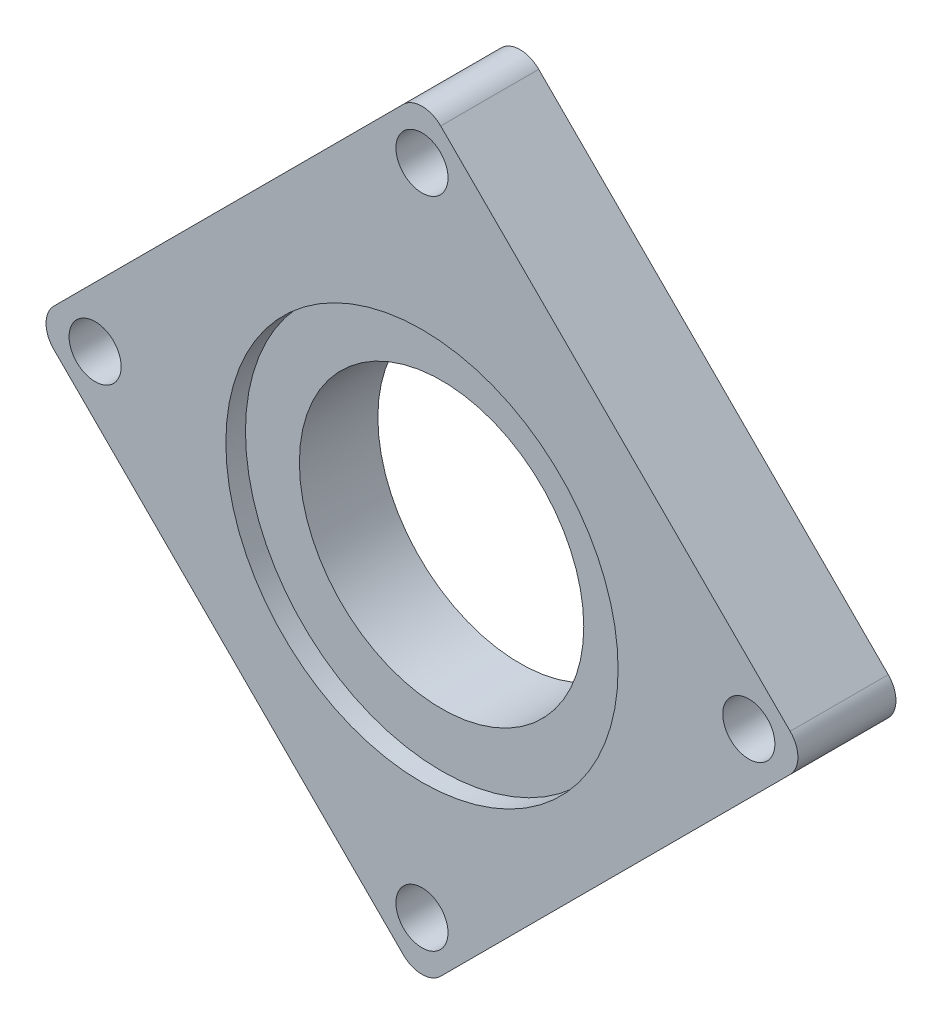
ISO-10303-21;
HEADER;
FILE_DESCRIPTION(('STEP AP214'),'2;1');
FILE_NAME('part.step','',(''),(''),'','','');
FILE_SCHEMA(('AUTOMOTIVE_DESIGN { 1 0 10303 214 1 1 1 1 }'));
ENDSEC;
DATA;
#1=APPLICATION_CONTEXT('core data for automotive mechanical design processes');
#2=APPLICATION_PROTOCOL_DEFINITION('international standard','automotive_design',2000,#1);
#3=PRODUCT_CONTEXT('',#1,'mechanical');
#4=PRODUCT('Part','Part','',(#3));
#5=PRODUCT_RELATED_PRODUCT_CATEGORY('part','',(#4));
#6=PRODUCT_DEFINITION_FORMATION('','',#4);
#7=PRODUCT_DEFINITION_CONTEXT('part definition',#1,'design');
#8=PRODUCT_DEFINITION('design','',#6,#7);
#9=PRODUCT_DEFINITION_SHAPE('','',#8);
#10=(LENGTH_UNIT() NAMED_UNIT(*) SI_UNIT(.MILLI.,.METRE.));
#11=(NAMED_UNIT(*) PLANE_ANGLE_UNIT() SI_UNIT($,.RADIAN.));
#12=(NAMED_UNIT(*) SI_UNIT($,.STERADIAN.) SOLID_ANGLE_UNIT());
#13=UNCERTAINTY_MEASURE_WITH_UNIT(LENGTH_MEASURE(1.E-05),#10,'distance_accuracy_value','');
#14=(GEOMETRIC_REPRESENTATION_CONTEXT(3) GLOBAL_UNCERTAINTY_ASSIGNED_CONTEXT((#13)) GLOBAL_UNIT_ASSIGNED_CONTEXT((#10,
#11,#12)) REPRESENTATION_CONTEXT('',''));
#15=CARTESIAN_POINT('',(0.,0.,0.));
#16=DIRECTION('',(0.,0.,1.));
#17=DIRECTION('',(1.,0.,0.));
#18=AXIS2_PLACEMENT_3D('',#15,#16,#17);
#19=CARTESIAN_POINT('',(58.9093516025737,45.0772658132579,10.));
#20=DIRECTION('',(0.,0.,-1.));
#21=DIRECTION('',(-1.,0.,0.));
#22=AXIS2_PLACEMENT_3D('',#19,#20,#21);
#23=CYLINDRICAL_SURFACE('',#22,14.5);
#24=CARTESIAN_POINT('',(58.9093516025737,45.0772658132579,0.));
#25=DIRECTION('',(0.,0.,1.));
#26=DIRECTION('',(1.,0.,0.));
#27=AXIS2_PLACEMENT_3D('',#24,#25,#26);
#28=CIRCLE('',#27,14.5);
#29=CARTESIAN_POINT('',(73.4093516025737,45.0772658132579,0.));
#30=VERTEX_POINT('',#29);
#31=EDGE_CURVE('E138',#30,#30,#28,.T.);
#32=ORIENTED_EDGE('',*,*,#31,.F.);
#33=EDGE_LOOP('',(#32));
#34=FACE_BOUND('',#33,.T.);
#35=CARTESIAN_POINT('',(58.9093516025737,45.0772658132579,8.));
#36=DIRECTION('',(0.,0.,1.));
#37=DIRECTION('',(1.,0.,0.));
#38=AXIS2_PLACEMENT_3D('',#35,#36,#37);
#39=CIRCLE('',#38,14.5);
#40=CARTESIAN_POINT('',(73.4093516025737,45.0772658132579,8.));
#41=VERTEX_POINT('',#40);
#42=EDGE_CURVE('E39',#41,#41,#39,.T.);
#43=ORIENTED_EDGE('',*,*,#42,.T.);
#44=EDGE_LOOP('',(#43));
#45=FACE_BOUND('',#44,.T.);
#46=ADVANCED_FACE('F35',(#34,#45),#23,.F.);
#47=CARTESIAN_POINT('',(94.5475333743754,46.4576834611031,10.));
#48=DIRECTION('',(0.,0.,1.));
#49=DIRECTION('',(1.,0.,0.));
#50=AXIS2_PLACEMENT_3D('',#47,#48,#49);
#51=PLANE('',#50);
#52=CARTESIAN_POINT('',(58.9093516025737,45.0772658132579,10.));
#53=DIRECTION('',(0.,0.,1.));
#54=DIRECTION('',(1.,0.,0.));
#55=AXIS2_PLACEMENT_3D('',#52,#53,#54);
#56=CIRCLE('',#55,20.);
#57=CARTESIAN_POINT('',(78.9093516025737,45.0772658132579,10.));
#58=VERTEX_POINT('',#57);
#59=EDGE_CURVE('E210',#58,#58,#56,.T.);
#60=ORIENTED_EDGE('',*,*,#59,.F.);
#61=EDGE_LOOP('',(#60));
#62=FACE_BOUND('',#61,.T.);
#63=CARTESIAN_POINT('',(58.9093516025736,79.7906971262372,10.));
#64=DIRECTION('',(0.,0.,1.));
#65=DIRECTION('',(1.,0.,0.));
#66=AXIS2_PLACEMENT_3D('',#63,#64,#65);
#67=CIRCLE('',#66,2.65560296279747);
#68=CARTESIAN_POINT('',(61.564954565371,79.7906971262372,10.));
#69=VERTEX_POINT('',#68);
#70=EDGE_CURVE('E196',#69,#69,#67,.T.);
#71=ORIENTED_EDGE('',*,*,#70,.F.);
#72=EDGE_LOOP('',(#71));
#73=FACE_BOUND('',#72,.T.);
#74=CARTESIAN_POINT('',(58.9093516025732,13.1246697959693,10.));
#75=DIRECTION('',(0.,0.,1.));
#76=DIRECTION('',(1.,0.,0.));
#77=AXIS2_PLACEMENT_3D('',#74,#75,#76);
#78=CIRCLE('',#77,2.65560296279745);
#79=CARTESIAN_POINT('',(61.5649545653707,13.1246697959693,10.));
#80=VERTEX_POINT('',#79);
#81=EDGE_CURVE('E186',#80,#80,#78,.T.);
#82=ORIENTED_EDGE('',*,*,#81,.F.);
#83=EDGE_LOOP('',(#82));
#84=FACE_BOUND('',#83,.T.);
#85=CARTESIAN_POINT('',(94.5475333743754,46.4576834611031,10.));
#86=DIRECTION('',(0.,0.,1.));
#87=DIRECTION('',(1.,0.,0.));
#88=AXIS2_PLACEMENT_3D('',#85,#86,#87);
#89=CIRCLE('',#88,2.7);
#90=CARTESIAN_POINT('',(96.4567216835791,44.5484951518994,10.));
#91=VERTEX_POINT('',#90);
#92=CARTESIAN_POINT('',(96.4567216835791,48.3668717703068,10.));
#93=VERTEX_POINT('',#92);
#94=EDGE_CURVE('E152',#91,#93,#89,.T.);
#95=ORIENTED_EDGE('',*,*,#94,.T.);
#96=DIRECTION('',(-0.707106781186543,0.707106781186552,0.));
#97=VECTOR('',#96,1.);
#98=CARTESIAN_POINT('',(96.4567216835791,48.3668717703068,10.));
#99=LINE('',#98,#97);
#100=CARTESIAN_POINT('',(60.8185399117773,84.005053542109,10.));
#101=VERTEX_POINT('',#100);
#102=EDGE_CURVE('E94',#93,#101,#99,.T.);
#103=ORIENTED_EDGE('',*,*,#102,.T.);
#104=CARTESIAN_POINT('',(58.9093516025737,82.0958652329053,10.));
#105=DIRECTION('',(0.,0.,1.));
#106=DIRECTION('',(1.,0.,0.));
#107=AXIS2_PLACEMENT_3D('',#104,#105,#106);
#108=CIRCLE('',#107,2.69999999999999);
#109=CARTESIAN_POINT('',(57.00016329337,84.005053542109,10.));
#110=VERTEX_POINT('',#109);
#111=EDGE_CURVE('E168',#101,#110,#108,.T.);
#112=ORIENTED_EDGE('',*,*,#111,.T.);
#113=DIRECTION('',(-0.707106781186552,-0.707106781186543,0.));
#114=VECTOR('',#113,1.);
#115=CARTESIAN_POINT('',(57.00016329337,84.005053542109,10.));
#116=LINE('',#115,#114);
#117=CARTESIAN_POINT('',(21.3619815215678,48.3668717703072,10.));
#118=VERTEX_POINT('',#117);
#119=EDGE_CURVE('E178',#110,#118,#116,.T.);
#120=ORIENTED_EDGE('',*,*,#119,.T.);
#121=CARTESIAN_POINT('',(23.2711698307715,46.4576834611035,10.));
#122=DIRECTION('',(0.,0.,1.));
#123=DIRECTION('',(1.,0.,0.));
#124=AXIS2_PLACEMENT_3D('',#121,#122,#123);
#125=CIRCLE('',#124,2.70000000000001);
#126=CARTESIAN_POINT('',(21.3619815215678,44.5484951518999,10.));
#127=VERTEX_POINT('',#126);
#128=EDGE_CURVE('E115',#118,#127,#125,.T.);
#129=ORIENTED_EDGE('',*,*,#128,.T.);
#130=DIRECTION('',(0.707106781186543,-0.707106781186552,0.));
#131=VECTOR('',#130,1.);
#132=CARTESIAN_POINT('',(21.3619815215678,44.5484951518999,10.));
#133=LINE('',#132,#131);
#134=CARTESIAN_POINT('',(57.0001632933695,8.91031338009766,10.));
#135=VERTEX_POINT('',#134);
#136=EDGE_CURVE('E107',#127,#135,#133,.T.);
#137=ORIENTED_EDGE('',*,*,#136,.T.);
#138=CARTESIAN_POINT('',(58.9093516025732,10.8195016893013,10.));
#139=DIRECTION('',(0.,0.,1.));
#140=DIRECTION('',(1.,0.,0.));
#141=AXIS2_PLACEMENT_3D('',#138,#139,#140);
#142=CIRCLE('',#141,2.7);
#143=CARTESIAN_POINT('',(60.8185399117769,8.91031338009764,10.));
#144=VERTEX_POINT('',#143);
#145=EDGE_CURVE('E112',#135,#144,#142,.T.);
#146=ORIENTED_EDGE('',*,*,#145,.T.);
#147=DIRECTION('',(0.707106781186552,0.707106781186543,0.));
#148=VECTOR('',#147,1.);
#149=CARTESIAN_POINT('',(60.8185399117769,8.91031338009764,10.));
#150=LINE('',#149,#148);
#151=EDGE_CURVE('E53',#144,#91,#150,.T.);
#152=ORIENTED_EDGE('',*,*,#151,.T.);
#153=EDGE_LOOP('',(#95,#103,#112,#120,#129,#137,#146,#152));
#154=FACE_BOUND('',#153,.T.);
#155=CARTESIAN_POINT('',(92.2423652677073,46.4576834611031,10.));
#156=DIRECTION('',(0.,0.,1.));
#157=DIRECTION('',(1.,0.,0.));
#158=AXIS2_PLACEMENT_3D('',#155,#156,#157);
#159=CIRCLE('',#158,2.65560296279748);
#160=CARTESIAN_POINT('',(94.8979682305048,46.4576834611031,10.));
#161=VERTEX_POINT('',#160);
#162=EDGE_CURVE('E190',#161,#161,#159,.T.);
#163=ORIENTED_EDGE('',*,*,#162,.F.);
#164=EDGE_LOOP('',(#163));
#165=FACE_BOUND('',#164,.T.);
#166=CARTESIAN_POINT('',(25.5763379374397,46.4576834611035,10.));
#167=DIRECTION('',(0.,0.,1.));
#168=DIRECTION('',(1.,0.,0.));
#169=AXIS2_PLACEMENT_3D('',#166,#167,#168);
#170=CIRCLE('',#169,2.65560296279746);
#171=CARTESIAN_POINT('',(28.2319409002371,46.4576834611035,10.));
#172=VERTEX_POINT('',#171);
#173=EDGE_CURVE('E202',#172,#172,#170,.T.);
#174=ORIENTED_EDGE('',*,*,#173,.F.);
#175=EDGE_LOOP('',(#174));
#176=FACE_BOUND('',#175,.T.);
#177=ADVANCED_FACE('F109',(#62,#73,#84,#154,#165,#176),#51,.T.);
#178=CARTESIAN_POINT('',(94.5475333743754,46.4576834611031,0.));
#179=DIRECTION('',(0.,0.,1.));
#180=DIRECTION('',(1.,0.,0.));
#181=AXIS2_PLACEMENT_3D('',#178,#179,#180);
#182=PLANE('',#181);
#183=CARTESIAN_POINT('',(94.5475333743754,46.4576834611031,0.));
#184=DIRECTION('',(0.,0.,1.));
#185=DIRECTION('',(1.,0.,0.));
#186=AXIS2_PLACEMENT_3D('',#183,#184,#185);
#187=CIRCLE('',#186,2.7);
#188=CARTESIAN_POINT('',(96.4567216835791,44.5484951518994,0.));
#189=VERTEX_POINT('',#188);
#190=CARTESIAN_POINT('',(96.4567216835791,48.3668717703068,0.));
#191=VERTEX_POINT('',#190);
#192=EDGE_CURVE('E134',#189,#191,#187,.T.);
#193=ORIENTED_EDGE('',*,*,#192,.F.);
#194=DIRECTION('',(0.707106781186552,0.707106781186543,0.));
#195=VECTOR('',#194,1.);
#196=CARTESIAN_POINT('',(92.4262130308157,40.5179864991361,0.));
#197=LINE('',#196,#195);
#198=CARTESIAN_POINT('',(60.8185399117769,8.91031338009764,0.));
#199=VERTEX_POINT('',#198);
#200=EDGE_CURVE('E82',#199,#189,#197,.T.);
#201=ORIENTED_EDGE('',*,*,#200,.F.);
#202=CARTESIAN_POINT('',(58.9093516025732,10.8195016893013,0.));
#203=DIRECTION('',(0.,0.,1.));
#204=DIRECTION('',(1.,0.,0.));
#205=AXIS2_PLACEMENT_3D('',#202,#203,#204);
#206=CIRCLE('',#205,2.7);
#207=CARTESIAN_POINT('',(57.0001632933695,8.91031338009766,0.));
#208=VERTEX_POINT('',#207);
#209=EDGE_CURVE('E149',#208,#199,#206,.T.);
#210=ORIENTED_EDGE('',*,*,#209,.F.);
#211=DIRECTION('',(0.707106781186543,-0.707106781186552,0.));
#212=VECTOR('',#211,1.);
#213=CARTESIAN_POINT('',(52.9696546406062,12.940822032861,0.));
#214=LINE('',#213,#212);
#215=CARTESIAN_POINT('',(21.3619815215678,44.5484951518999,0.));
#216=VERTEX_POINT('',#215);
#217=EDGE_CURVE('E123',#216,#208,#214,.T.);
#218=ORIENTED_EDGE('',*,*,#217,.F.);
#219=CARTESIAN_POINT('',(23.2711698307715,46.4576834611035,0.));
#220=DIRECTION('',(0.,0.,1.));
#221=DIRECTION('',(1.,0.,0.));
#222=AXIS2_PLACEMENT_3D('',#219,#220,#221);
#223=CIRCLE('',#222,2.70000000000001);
#224=CARTESIAN_POINT('',(21.3619815215678,48.3668717703072,0.));
#225=VERTEX_POINT('',#224);
#226=EDGE_CURVE('E145',#225,#216,#223,.T.);
#227=ORIENTED_EDGE('',*,*,#226,.F.);
#228=DIRECTION('',(-0.707106781186553,-0.707106781186542,0.));
#229=VECTOR('',#228,1.);
#230=CARTESIAN_POINT('',(25.3924901743311,52.3973804230705,0.));
#231=LINE('',#230,#229);
#232=CARTESIAN_POINT('',(57.00016329337,84.005053542109,0.));
#233=VERTEX_POINT('',#232);
#234=EDGE_CURVE('E143',#233,#225,#231,.T.);
#235=ORIENTED_EDGE('',*,*,#234,.F.);
#236=CARTESIAN_POINT('',(58.9093516025737,82.0958652329053,0.));
#237=DIRECTION('',(0.,0.,1.));
#238=DIRECTION('',(1.,0.,0.));
#239=AXIS2_PLACEMENT_3D('',#236,#237,#238);
#240=CIRCLE('',#239,2.69999999999999);
#241=CARTESIAN_POINT('',(60.8185399117773,84.005053542109,0.));
#242=VERTEX_POINT('',#241);
#243=EDGE_CURVE('E140',#242,#233,#240,.T.);
#244=ORIENTED_EDGE('',*,*,#243,.F.);
#245=DIRECTION('',(-0.707106781186543,0.707106781186552,0.));
#246=VECTOR('',#245,1.);
#247=CARTESIAN_POINT('',(64.8490485645406,79.9745448893457,0.));
#248=LINE('',#247,#246);
#249=EDGE_CURVE('E137',#191,#242,#248,.T.);
#250=ORIENTED_EDGE('',*,*,#249,.F.);
#251=EDGE_LOOP('',(#193,#201,#210,#218,#227,#235,#244,#250));
#252=FACE_BOUND('',#251,.T.);
#253=ORIENTED_EDGE('',*,*,#31,.T.);
#254=EDGE_LOOP('',(#253));
#255=FACE_BOUND('',#254,.T.);
#256=CARTESIAN_POINT('',(58.9093516025732,13.1246697959693,0.));
#257=DIRECTION('',(0.,0.,1.));
#258=DIRECTION('',(1.,0.,0.));
#259=AXIS2_PLACEMENT_3D('',#256,#257,#258);
#260=CIRCLE('',#259,2.65560296279745);
#261=CARTESIAN_POINT('',(61.5649545653707,13.1246697959693,0.));
#262=VERTEX_POINT('',#261);
#263=EDGE_CURVE('E187',#262,#262,#260,.T.);
#264=ORIENTED_EDGE('',*,*,#263,.T.);
#265=EDGE_LOOP('',(#264));
#266=FACE_BOUND('',#265,.T.);
#267=CARTESIAN_POINT('',(92.2423652677073,46.4576834611031,0.));
#268=DIRECTION('',(0.,0.,1.));
#269=DIRECTION('',(1.,0.,0.));
#270=AXIS2_PLACEMENT_3D('',#267,#268,#269);
#271=CIRCLE('',#270,2.65560296279748);
#272=CARTESIAN_POINT('',(94.8979682305048,46.4576834611031,0.));
#273=VERTEX_POINT('',#272);
#274=EDGE_CURVE('E193',#273,#273,#271,.T.);
#275=ORIENTED_EDGE('',*,*,#274,.T.);
#276=EDGE_LOOP('',(#275));
#277=FACE_BOUND('',#276,.T.);
#278=CARTESIAN_POINT('',(58.9093516025736,79.7906971262372,0.));
#279=DIRECTION('',(0.,0.,1.));
#280=DIRECTION('',(1.,0.,0.));
#281=AXIS2_PLACEMENT_3D('',#278,#279,#280);
#282=CIRCLE('',#281,2.65560296279747);
#283=CARTESIAN_POINT('',(61.564954565371,79.7906971262372,0.));
#284=VERTEX_POINT('',#283);
#285=EDGE_CURVE('E199',#284,#284,#282,.T.);
#286=ORIENTED_EDGE('',*,*,#285,.T.);
#287=EDGE_LOOP('',(#286));
#288=FACE_BOUND('',#287,.T.);
#289=CARTESIAN_POINT('',(25.5763379374397,46.4576834611035,0.));
#290=DIRECTION('',(0.,0.,1.));
#291=DIRECTION('',(1.,0.,0.));
#292=AXIS2_PLACEMENT_3D('',#289,#290,#291);
#293=CIRCLE('',#292,2.65560296279746);
#294=CARTESIAN_POINT('',(28.2319409002371,46.4576834611035,0.));
#295=VERTEX_POINT('',#294);
#296=EDGE_CURVE('E205',#295,#295,#293,.T.);
#297=ORIENTED_EDGE('',*,*,#296,.T.);
#298=EDGE_LOOP('',(#297));
#299=FACE_BOUND('',#298,.T.);
#300=ADVANCED_FACE('F169',(#252,#255,#266,#277,#288,#299),#182,.F.);
#301=CARTESIAN_POINT('',(94.5475333743754,46.4576834611031,10.));
#302=DIRECTION('',(0.,0.,-1.));
#303=DIRECTION('',(-1.,0.,0.));
#304=AXIS2_PLACEMENT_3D('',#301,#302,#303);
#305=CYLINDRICAL_SURFACE('',#304,2.7);
#306=ORIENTED_EDGE('',*,*,#192,.T.);
#307=DIRECTION('',(0.,0.,-1.));
#308=VECTOR('',#307,1.);
#309=CARTESIAN_POINT('',(96.4567216835791,48.3668717703068,10.));
#310=LINE('',#309,#308);
#311=EDGE_CURVE('E11',#93,#191,#310,.T.);
#312=ORIENTED_EDGE('',*,*,#311,.F.);
#313=ORIENTED_EDGE('',*,*,#94,.F.);
#314=DIRECTION('',(0.,0.,-1.));
#315=VECTOR('',#314,1.);
#316=CARTESIAN_POINT('',(96.4567216835791,44.5484951518994,10.));
#317=LINE('',#316,#315);
#318=EDGE_CURVE('E130',#91,#189,#317,.T.);
#319=ORIENTED_EDGE('',*,*,#318,.T.);
#320=EDGE_LOOP('',(#306,#312,#313,#319));
#321=FACE_BOUND('',#320,.T.);
#322=ADVANCED_FACE('F37',(#321),#305,.T.);
#323=CARTESIAN_POINT('',(64.8490485645406,79.9745448893457,10.));
#324=DIRECTION('',(-0.707106781186552,-0.707106781186543,0.));
#325=DIRECTION('',(0.707106781186543,-0.707106781186552,0.));
#326=AXIS2_PLACEMENT_3D('',#323,#324,#325);
#327=PLANE('',#326);
#328=ORIENTED_EDGE('',*,*,#249,.T.);
#329=DIRECTION('',(0.,0.,-1.));
#330=VECTOR('',#329,1.);
#331=CARTESIAN_POINT('',(60.8185399117773,84.005053542109,10.));
#332=LINE('',#331,#330);
#333=EDGE_CURVE('E45',#101,#242,#332,.T.);
#334=ORIENTED_EDGE('',*,*,#333,.F.);
#335=ORIENTED_EDGE('',*,*,#102,.F.);
#336=ORIENTED_EDGE('',*,*,#311,.T.);
#337=EDGE_LOOP('',(#328,#334,#335,#336));
#338=FACE_BOUND('',#337,.T.);
#339=ADVANCED_FACE('F258',(#338),#327,.F.);
#340=CARTESIAN_POINT('',(58.9093516025737,82.0958652329053,10.));
#341=DIRECTION('',(0.,0.,-1.));
#342=DIRECTION('',(-1.,0.,0.));
#343=AXIS2_PLACEMENT_3D('',#340,#341,#342);
#344=CYLINDRICAL_SURFACE('',#343,2.69999999999999);
#345=ORIENTED_EDGE('',*,*,#243,.T.);
#346=DIRECTION('',(0.,0.,-1.));
#347=VECTOR('',#346,1.);
#348=CARTESIAN_POINT('',(57.00016329337,84.005053542109,10.));
#349=LINE('',#348,#347);
#350=EDGE_CURVE('E159',#110,#233,#349,.T.);
#351=ORIENTED_EDGE('',*,*,#350,.F.);
#352=ORIENTED_EDGE('',*,*,#111,.F.);
#353=ORIENTED_EDGE('',*,*,#333,.T.);
#354=EDGE_LOOP('',(#345,#351,#352,#353));
#355=FACE_BOUND('',#354,.T.);
#356=ADVANCED_FACE('F166',(#355),#344,.T.);
#357=CARTESIAN_POINT('',(25.3924901743311,52.3973804230705,10.));
#358=DIRECTION('',(0.707106781186542,-0.707106781186553,0.));
#359=DIRECTION('',(0.707106781186553,0.707106781186542,0.));
#360=AXIS2_PLACEMENT_3D('',#357,#358,#359);
#361=PLANE('',#360);
#362=ORIENTED_EDGE('',*,*,#234,.T.);
#363=DIRECTION('',(0.,0.,-1.));
#364=VECTOR('',#363,1.);
#365=CARTESIAN_POINT('',(21.3619815215678,48.3668717703072,10.));
#366=LINE('',#365,#364);
#367=EDGE_CURVE('E156',#118,#225,#366,.T.);
#368=ORIENTED_EDGE('',*,*,#367,.F.);
#369=ORIENTED_EDGE('',*,*,#119,.F.);
#370=ORIENTED_EDGE('',*,*,#350,.T.);
#371=EDGE_LOOP('',(#362,#368,#369,#370));
#372=FACE_BOUND('',#371,.T.);
#373=ADVANCED_FACE('F174',(#372),#361,.F.);
#374=CARTESIAN_POINT('',(23.2711698307715,46.4576834611035,10.));
#375=DIRECTION('',(0.,0.,-1.));
#376=DIRECTION('',(-1.,0.,0.));
#377=AXIS2_PLACEMENT_3D('',#374,#375,#376);
#378=CYLINDRICAL_SURFACE('',#377,2.70000000000001);
#379=ORIENTED_EDGE('',*,*,#226,.T.);
#380=DIRECTION('',(0.,0.,-1.));
#381=VECTOR('',#380,1.);
#382=CARTESIAN_POINT('',(21.3619815215678,44.5484951518999,10.));
#383=LINE('',#382,#381);
#384=EDGE_CURVE('E125',#127,#216,#383,.T.);
#385=ORIENTED_EDGE('',*,*,#384,.F.);
#386=ORIENTED_EDGE('',*,*,#128,.F.);
#387=ORIENTED_EDGE('',*,*,#367,.T.);
#388=EDGE_LOOP('',(#379,#385,#386,#387));
#389=FACE_BOUND('',#388,.T.);
#390=ADVANCED_FACE('F177',(#389),#378,.T.);
#391=CARTESIAN_POINT('',(52.9696546406062,12.940822032861,10.));
#392=DIRECTION('',(0.707106781186552,0.707106781186543,0.));
#393=DIRECTION('',(-0.707106781186543,0.707106781186552,0.));
#394=AXIS2_PLACEMENT_3D('',#391,#392,#393);
#395=PLANE('',#394);
#396=ORIENTED_EDGE('',*,*,#217,.T.);
#397=DIRECTION('',(0.,0.,-1.));
#398=VECTOR('',#397,1.);
#399=CARTESIAN_POINT('',(57.0001632933695,8.91031338009766,10.));
#400=LINE('',#399,#398);
#401=EDGE_CURVE('E121',#135,#208,#400,.T.);
#402=ORIENTED_EDGE('',*,*,#401,.F.);
#403=ORIENTED_EDGE('',*,*,#136,.F.);
#404=ORIENTED_EDGE('',*,*,#384,.T.);
#405=EDGE_LOOP('',(#396,#402,#403,#404));
#406=FACE_BOUND('',#405,.T.);
#407=ADVANCED_FACE('F122',(#406),#395,.F.);
#408=CARTESIAN_POINT('',(58.9093516025732,10.8195016893013,10.));
#409=DIRECTION('',(0.,0.,-1.));
#410=DIRECTION('',(-1.,0.,0.));
#411=AXIS2_PLACEMENT_3D('',#408,#409,#410);
#412=CYLINDRICAL_SURFACE('',#411,2.7);
#413=ORIENTED_EDGE('',*,*,#209,.T.);
#414=DIRECTION('',(0.,0.,-1.));
#415=VECTOR('',#414,1.);
#416=CARTESIAN_POINT('',(60.8185399117769,8.91031338009764,10.));
#417=LINE('',#416,#415);
#418=EDGE_CURVE('E126',#144,#199,#417,.T.);
#419=ORIENTED_EDGE('',*,*,#418,.F.);
#420=ORIENTED_EDGE('',*,*,#145,.F.);
#421=ORIENTED_EDGE('',*,*,#401,.T.);
#422=EDGE_LOOP('',(#413,#419,#420,#421));
#423=FACE_BOUND('',#422,.T.);
#424=ADVANCED_FACE('F128',(#423),#412,.T.);
#425=CARTESIAN_POINT('',(92.4262130308157,40.5179864991361,10.));
#426=DIRECTION('',(-0.707106781186543,0.707106781186552,0.));
#427=DIRECTION('',(-0.707106781186552,-0.707106781186543,0.));
#428=AXIS2_PLACEMENT_3D('',#425,#426,#427);
#429=PLANE('',#428);
#430=ORIENTED_EDGE('',*,*,#200,.T.);
#431=ORIENTED_EDGE('',*,*,#318,.F.);
#432=ORIENTED_EDGE('',*,*,#151,.F.);
#433=ORIENTED_EDGE('',*,*,#418,.T.);
#434=EDGE_LOOP('',(#430,#431,#432,#433));
#435=FACE_BOUND('',#434,.T.);
#436=ADVANCED_FACE('F246',(#435),#429,.F.);
#437=CARTESIAN_POINT('',(58.9093516025732,13.1246697959693,10.));
#438=DIRECTION('',(0.,0.,-1.));
#439=DIRECTION('',(-1.,0.,0.));
#440=AXIS2_PLACEMENT_3D('',#437,#438,#439);
#441=CYLINDRICAL_SURFACE('',#440,2.65560296279745);
#442=ORIENTED_EDGE('',*,*,#81,.T.);
#443=EDGE_LOOP('',(#442));
#444=FACE_BOUND('',#443,.T.);
#445=ORIENTED_EDGE('',*,*,#263,.F.);
#446=EDGE_LOOP('',(#445));
#447=FACE_BOUND('',#446,.T.);
#448=ADVANCED_FACE('F241',(#444,#447),#441,.F.);
#449=CARTESIAN_POINT('',(92.2423652677073,46.4576834611031,10.));
#450=DIRECTION('',(0.,0.,-1.));
#451=DIRECTION('',(-1.,0.,0.));
#452=AXIS2_PLACEMENT_3D('',#449,#450,#451);
#453=CYLINDRICAL_SURFACE('',#452,2.65560296279748);
#454=ORIENTED_EDGE('',*,*,#162,.T.);
#455=EDGE_LOOP('',(#454));
#456=FACE_BOUND('',#455,.T.);
#457=ORIENTED_EDGE('',*,*,#274,.F.);
#458=EDGE_LOOP('',(#457));
#459=FACE_BOUND('',#458,.T.);
#460=ADVANCED_FACE('F304',(#456,#459),#453,.F.);
#461=CARTESIAN_POINT('',(58.9093516025736,79.7906971262372,10.));
#462=DIRECTION('',(0.,0.,-1.));
#463=DIRECTION('',(-1.,0.,0.));
#464=AXIS2_PLACEMENT_3D('',#461,#462,#463);
#465=CYLINDRICAL_SURFACE('',#464,2.65560296279747);
#466=ORIENTED_EDGE('',*,*,#70,.T.);
#467=EDGE_LOOP('',(#466));
#468=FACE_BOUND('',#467,.T.);
#469=ORIENTED_EDGE('',*,*,#285,.F.);
#470=EDGE_LOOP('',(#469));
#471=FACE_BOUND('',#470,.T.);
#472=ADVANCED_FACE('F296',(#468,#471),#465,.F.);
#473=CARTESIAN_POINT('',(25.5763379374397,46.4576834611035,10.));
#474=DIRECTION('',(0.,0.,-1.));
#475=DIRECTION('',(-1.,0.,0.));
#476=AXIS2_PLACEMENT_3D('',#473,#474,#475);
#477=CYLINDRICAL_SURFACE('',#476,2.65560296279746);
#478=ORIENTED_EDGE('',*,*,#173,.T.);
#479=EDGE_LOOP('',(#478));
#480=FACE_BOUND('',#479,.T.);
#481=ORIENTED_EDGE('',*,*,#296,.F.);
#482=EDGE_LOOP('',(#481));
#483=FACE_BOUND('',#482,.T.);
#484=ADVANCED_FACE('F228',(#480,#483),#477,.F.);
#485=CARTESIAN_POINT('',(58.9093516025737,45.0772658132579,8.));
#486=DIRECTION('',(0.,0.,1.));
#487=DIRECTION('',(1.,0.,0.));
#488=AXIS2_PLACEMENT_3D('',#485,#486,#487);
#489=CYLINDRICAL_SURFACE('',#488,20.);
#490=CARTESIAN_POINT('',(58.9093516025737,45.0772658132579,8.));
#491=DIRECTION('',(0.,0.,1.));
#492=DIRECTION('',(1.,0.,0.));
#493=AXIS2_PLACEMENT_3D('',#490,#491,#492);
#494=CIRCLE('',#493,20.);
#495=CARTESIAN_POINT('',(78.9093516025737,45.0772658132579,8.));
#496=VERTEX_POINT('',#495);
#497=EDGE_CURVE('E213',#496,#496,#494,.T.);
#498=ORIENTED_EDGE('',*,*,#497,.F.);
#499=EDGE_LOOP('',(#498));
#500=FACE_BOUND('',#499,.T.);
#501=ORIENTED_EDGE('',*,*,#59,.T.);
#502=EDGE_LOOP('',(#501));
#503=FACE_BOUND('',#502,.T.);
#504=ADVANCED_FACE('F223',(#500,#503),#489,.F.);
#505=CARTESIAN_POINT('',(58.9093516025737,45.0772658132579,8.));
#506=DIRECTION('',(0.,0.,1.));
#507=DIRECTION('',(1.,0.,0.));
#508=AXIS2_PLACEMENT_3D('',#505,#506,#507);
#509=PLANE('',#508);
#510=ORIENTED_EDGE('',*,*,#42,.F.);
#511=EDGE_LOOP('',(#510));
#512=FACE_BOUND('',#511,.T.);
#513=ORIENTED_EDGE('',*,*,#497,.T.);
#514=EDGE_LOOP('',(#513));
#515=FACE_BOUND('',#514,.T.);
#516=ADVANCED_FACE('F221',(#512,#515),#509,.T.);
#517=CLOSED_SHELL('',(#46,#177,#300,#322,#339,#356,#373,#390,#407,#424,#436,#448,#460,#472,#484,
#504,#516));
#518=MANIFOLD_SOLID_BREP('B2',#517);
#519=ADVANCED_BREP_SHAPE_REPRESENTATION('',(#18,#518),#14);
#520=SHAPE_DEFINITION_REPRESENTATION(#9,#519);
ENDSEC;
END-ISO-10303-21;
